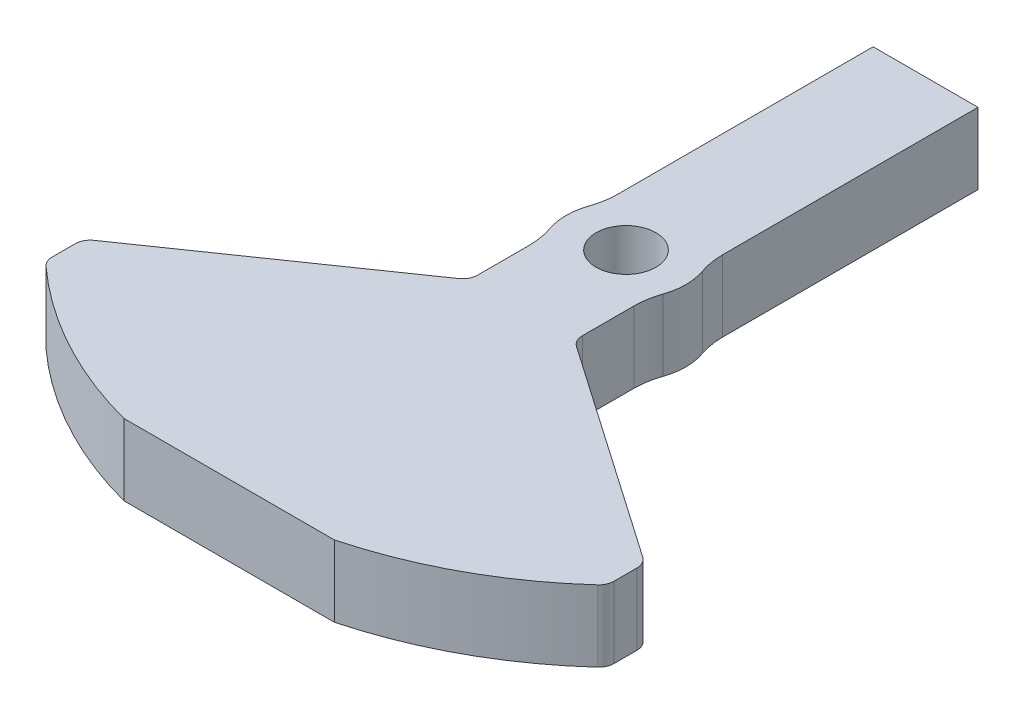
ISO-10303-21;
HEADER;
FILE_DESCRIPTION(('STEP AP214'),'2;1');
FILE_NAME('part.step','',(''),(''),'','','');
FILE_SCHEMA(('AUTOMOTIVE_DESIGN { 1 0 10303 214 1 1 1 1 }'));
ENDSEC;
DATA;
#1=APPLICATION_CONTEXT('core data for automotive mechanical design processes');
#2=APPLICATION_PROTOCOL_DEFINITION('international standard','automotive_design',2000,#1);
#3=PRODUCT_CONTEXT('',#1,'mechanical');
#4=PRODUCT('Part','Part','',(#3));
#5=PRODUCT_RELATED_PRODUCT_CATEGORY('part','',(#4));
#6=PRODUCT_DEFINITION_FORMATION('','',#4);
#7=PRODUCT_DEFINITION_CONTEXT('part definition',#1,'design');
#8=PRODUCT_DEFINITION('design','',#6,#7);
#9=PRODUCT_DEFINITION_SHAPE('','',#8);
#10=(LENGTH_UNIT() NAMED_UNIT(*) SI_UNIT(.MILLI.,.METRE.));
#11=(NAMED_UNIT(*) PLANE_ANGLE_UNIT() SI_UNIT($,.RADIAN.));
#12=(NAMED_UNIT(*) SI_UNIT($,.STERADIAN.) SOLID_ANGLE_UNIT());
#13=UNCERTAINTY_MEASURE_WITH_UNIT(LENGTH_MEASURE(1.E-05),#10,'distance_accuracy_value','');
#14=(GEOMETRIC_REPRESENTATION_CONTEXT(3) GLOBAL_UNCERTAINTY_ASSIGNED_CONTEXT((#13)) GLOBAL_UNIT_ASSIGNED_CONTEXT((#10,
#11,#12)) REPRESENTATION_CONTEXT('',''));
#15=CARTESIAN_POINT('',(0.,0.,0.));
#16=DIRECTION('',(0.,0.,1.));
#17=DIRECTION('',(1.,0.,0.));
#18=AXIS2_PLACEMENT_3D('',#15,#16,#17);
#19=CARTESIAN_POINT('',(0.,9.525,0.));
#20=DIRECTION('',(0.,1.,0.));
#21=DIRECTION('',(0.,0.,1.));
#22=AXIS2_PLACEMENT_3D('',#19,#20,#21);
#23=PLANE('',#22);
#24=CARTESIAN_POINT('',(0.,9.525,0.));
#25=DIRECTION('',(0.,1.,0.));
#26=DIRECTION('',(0.,0.,1.));
#27=AXIS2_PLACEMENT_3D('',#24,#25,#26);
#28=CIRCLE('',#27,54.8292804986533);
#29=CARTESIAN_POINT('',(14.0445719051882,9.525,53.));
#30=VERTEX_POINT('',#29);
#31=CARTESIAN_POINT('',(36.8439516747121,9.525,40.6050886588304));
#32=VERTEX_POINT('',#31);
#33=EDGE_CURVE('E240',#30,#32,#28,.T.);
#34=ORIENTED_EDGE('',*,*,#33,.T.);
#35=CARTESIAN_POINT('',(35.5,9.525,39.1239425161293));
#36=DIRECTION('',(0.,1.,0.));
#37=DIRECTION('',(0.,0.,1.));
#38=AXIS2_PLACEMENT_3D('',#35,#36,#37);
#39=CIRCLE('',#38,2.);
#40=CARTESIAN_POINT('',(37.5,9.525,39.1239425161293));
#41=VERTEX_POINT('',#40);
#42=EDGE_CURVE('E362',#32,#41,#39,.T.);
#43=ORIENTED_EDGE('',*,*,#42,.T.);
#44=DIRECTION('',(0.,0.,-1.));
#45=VECTOR('',#44,1.);
#46=CARTESIAN_POINT('',(37.5,9.525,35.));
#47=LINE('',#46,#45);
#48=CARTESIAN_POINT('',(37.5,9.525,36.0475773853247));
#49=VERTEX_POINT('',#48);
#50=EDGE_CURVE('E243',#41,#49,#47,.T.);
#51=ORIENTED_EDGE('',*,*,#50,.T.);
#52=CARTESIAN_POINT('',(35.5,9.525,36.0475773853247));
#53=DIRECTION('',(0.,1.,0.));
#54=DIRECTION('',(0.,0.,1.));
#55=AXIS2_PLACEMENT_3D('',#52,#53,#54);
#56=CIRCLE('',#55,2.);
#57=CARTESIAN_POINT('',(36.638843785766,9.525,34.403486502307));
#58=VERTEX_POINT('',#57);
#59=EDGE_CURVE('E360',#49,#58,#56,.T.);
#60=ORIENTED_EDGE('',*,*,#59,.T.);
#61=DIRECTION('',(-0.822045441508871,0.,-0.569421892883023));
#62=VECTOR('',#61,1.);
#63=CARTESIAN_POINT('',(6.99999999999999,9.525,13.8729833462074));
#64=LINE('',#63,#62);
#65=CARTESIAN_POINT('',(7.86115621423395,9.525,14.4694968439005));
#66=VERTEX_POINT('',#65);
#67=EDGE_CURVE('E246',#58,#66,#64,.T.);
#68=ORIENTED_EDGE('',*,*,#67,.T.);
#69=CARTESIAN_POINT('',(8.99999999999999,9.525,12.8254059608827));
#70=DIRECTION('',(0.,1.,0.));
#71=DIRECTION('',(0.,0.,1.));
#72=AXIS2_PLACEMENT_3D('',#69,#70,#71);
#73=CIRCLE('',#72,2.);
#74=CARTESIAN_POINT('',(6.99999999999999,9.525,12.8254059608827));
#75=VERTEX_POINT('',#74);
#76=EDGE_CURVE('E50',#66,#75,#73,.F.);
#77=ORIENTED_EDGE('',*,*,#76,.T.);
#78=DIRECTION('',(0.,0.,-1.));
#79=VECTOR('',#78,1.);
#80=CARTESIAN_POINT('',(6.99999999999999,9.525,3.87298334620743));
#81=LINE('',#80,#79);
#82=CARTESIAN_POINT('',(6.99999999999999,9.525,5.91607978309966));
#83=VERTEX_POINT('',#82);
#84=EDGE_CURVE('E248',#75,#83,#81,.T.);
#85=ORIENTED_EDGE('',*,*,#84,.T.);
#86=CARTESIAN_POINT('',(17.,9.525,5.91607978309966));
#87=DIRECTION('',(0.,1.,0.));
#88=DIRECTION('',(0.,0.,1.));
#89=AXIS2_PLACEMENT_3D('',#86,#87,#88);
#90=CIRCLE('',#89,10.);
#91=CARTESIAN_POINT('',(7.55555555555555,9.525,2.62936879248874));
#92=VERTEX_POINT('',#91);
#93=EDGE_CURVE('E335',#83,#92,#90,.F.);
#94=ORIENTED_EDGE('',*,*,#93,.T.);
#95=CARTESIAN_POINT('',(0.,9.525,0.));
#96=DIRECTION('',(0.,1.,0.));
#97=DIRECTION('',(0.,0.,1.));
#98=AXIS2_PLACEMENT_3D('',#95,#96,#97);
#99=CIRCLE('',#98,8.);
#100=CARTESIAN_POINT('',(7.55555555555555,9.525,-2.62936879248873));
#101=VERTEX_POINT('',#100);
#102=EDGE_CURVE('E250',#92,#101,#99,.T.);
#103=ORIENTED_EDGE('',*,*,#102,.T.);
#104=CARTESIAN_POINT('',(17.,9.525,-5.91607978309964));
#105=DIRECTION('',(0.,1.,0.));
#106=DIRECTION('',(0.,0.,1.));
#107=AXIS2_PLACEMENT_3D('',#104,#105,#106);
#108=CIRCLE('',#107,10.);
#109=CARTESIAN_POINT('',(7.,9.525,-5.91607978309964));
#110=VERTEX_POINT('',#109);
#111=EDGE_CURVE('E330',#101,#110,#108,.F.);
#112=ORIENTED_EDGE('',*,*,#111,.T.);
#113=DIRECTION('',(0.,0.,-1.));
#114=VECTOR('',#113,1.);
#115=CARTESIAN_POINT('',(7.,9.525,-40.));
#116=LINE('',#115,#114);
#117=CARTESIAN_POINT('',(7.,9.525,-40.));
#118=VERTEX_POINT('',#117);
#119=EDGE_CURVE('E253',#110,#118,#116,.T.);
#120=ORIENTED_EDGE('',*,*,#119,.T.);
#121=DIRECTION('',(-1.,0.,0.));
#122=VECTOR('',#121,1.);
#123=CARTESIAN_POINT('',(-7.,9.525,-40.));
#124=LINE('',#123,#122);
#125=CARTESIAN_POINT('',(-7.,9.525,-40.));
#126=VERTEX_POINT('',#125);
#127=EDGE_CURVE('E255',#118,#126,#124,.T.);
#128=ORIENTED_EDGE('',*,*,#127,.T.);
#129=DIRECTION('',(0.,0.,1.));
#130=VECTOR('',#129,1.);
#131=CARTESIAN_POINT('',(-7.,9.525,-40.));
#132=LINE('',#131,#130);
#133=CARTESIAN_POINT('',(-6.99999999999999,9.525,-5.91607978309967));
#134=VERTEX_POINT('',#133);
#135=EDGE_CURVE('E220',#126,#134,#132,.T.);
#136=ORIENTED_EDGE('',*,*,#135,.T.);
#137=CARTESIAN_POINT('',(-17.,9.525,-5.91607978309966));
#138=DIRECTION('',(0.,1.,0.));
#139=DIRECTION('',(0.,0.,1.));
#140=AXIS2_PLACEMENT_3D('',#137,#138,#139);
#141=CIRCLE('',#140,10.);
#142=CARTESIAN_POINT('',(-7.55555555555555,9.525,-2.62936879248874));
#143=VERTEX_POINT('',#142);
#144=EDGE_CURVE('E326',#134,#143,#141,.F.);
#145=ORIENTED_EDGE('',*,*,#144,.T.);
#146=CARTESIAN_POINT('',(0.,9.525,0.));
#147=DIRECTION('',(0.,1.,0.));
#148=DIRECTION('',(0.,0.,1.));
#149=AXIS2_PLACEMENT_3D('',#146,#147,#148);
#150=CIRCLE('',#149,8.);
#151=CARTESIAN_POINT('',(-7.55555555555555,9.525,2.62936879248874));
#152=VERTEX_POINT('',#151);
#153=EDGE_CURVE('E223',#143,#152,#150,.T.);
#154=ORIENTED_EDGE('',*,*,#153,.T.);
#155=CARTESIAN_POINT('',(-17.,9.525,5.91607978309966));
#156=DIRECTION('',(0.,1.,0.));
#157=DIRECTION('',(0.,0.,1.));
#158=AXIS2_PLACEMENT_3D('',#155,#156,#157);
#159=CIRCLE('',#158,10.);
#160=CARTESIAN_POINT('',(-6.99999999999999,9.525,5.91607978309966));
#161=VERTEX_POINT('',#160);
#162=EDGE_CURVE('E339',#152,#161,#159,.F.);
#163=ORIENTED_EDGE('',*,*,#162,.T.);
#164=DIRECTION('',(0.,0.,1.));
#165=VECTOR('',#164,1.);
#166=CARTESIAN_POINT('',(-6.99999999999999,9.525,3.87298334620743));
#167=LINE('',#166,#165);
#168=CARTESIAN_POINT('',(-6.99999999999999,9.525,12.8254059608827));
#169=VERTEX_POINT('',#168);
#170=EDGE_CURVE('E227',#161,#169,#167,.T.);
#171=ORIENTED_EDGE('',*,*,#170,.T.);
#172=CARTESIAN_POINT('',(-8.99999999999999,9.525,12.8254059608827));
#173=DIRECTION('',(0.,1.,0.));
#174=DIRECTION('',(0.,0.,1.));
#175=AXIS2_PLACEMENT_3D('',#172,#173,#174);
#176=CIRCLE('',#175,2.);
#177=CARTESIAN_POINT('',(-7.86115621423394,9.525,14.4694968439005));
#178=VERTEX_POINT('',#177);
#179=EDGE_CURVE('E11',#169,#178,#176,.F.);
#180=ORIENTED_EDGE('',*,*,#179,.T.);
#181=DIRECTION('',(-0.822045441508871,0.,0.569421892883023));
#182=VECTOR('',#181,1.);
#183=CARTESIAN_POINT('',(-37.5,9.525,35.));
#184=LINE('',#183,#182);
#185=CARTESIAN_POINT('',(-36.638843785766,9.525,34.403486502307));
#186=VERTEX_POINT('',#185);
#187=EDGE_CURVE('E230',#178,#186,#184,.T.);
#188=ORIENTED_EDGE('',*,*,#187,.T.);
#189=CARTESIAN_POINT('',(-35.5,9.525,36.0475773853247));
#190=DIRECTION('',(0.,1.,0.));
#191=DIRECTION('',(0.,0.,1.));
#192=AXIS2_PLACEMENT_3D('',#189,#190,#191);
#193=CIRCLE('',#192,2.);
#194=CARTESIAN_POINT('',(-37.5,9.525,36.0475773853247));
#195=VERTEX_POINT('',#194);
#196=EDGE_CURVE('E356',#186,#195,#193,.T.);
#197=ORIENTED_EDGE('',*,*,#196,.T.);
#198=DIRECTION('',(0.,0.,1.));
#199=VECTOR('',#198,1.);
#200=CARTESIAN_POINT('',(-37.5,9.525,35.));
#201=LINE('',#200,#199);
#202=CARTESIAN_POINT('',(-37.5,9.525,39.1239425161293));
#203=VERTEX_POINT('',#202);
#204=EDGE_CURVE('E233',#195,#203,#201,.T.);
#205=ORIENTED_EDGE('',*,*,#204,.T.);
#206=CARTESIAN_POINT('',(-35.5,9.525,39.1239425161293));
#207=DIRECTION('',(0.,1.,0.));
#208=DIRECTION('',(0.,0.,1.));
#209=AXIS2_PLACEMENT_3D('',#206,#207,#208);
#210=CIRCLE('',#209,2.);
#211=CARTESIAN_POINT('',(-36.8439516747121,9.525,40.6050886588304));
#212=VERTEX_POINT('',#211);
#213=EDGE_CURVE('E358',#203,#212,#210,.T.);
#214=ORIENTED_EDGE('',*,*,#213,.T.);
#215=CARTESIAN_POINT('',(0.,9.525,0.));
#216=DIRECTION('',(0.,1.,0.));
#217=DIRECTION('',(0.,0.,1.));
#218=AXIS2_PLACEMENT_3D('',#215,#216,#217);
#219=CIRCLE('',#218,54.8292804986533);
#220=CARTESIAN_POINT('',(-14.0445719051882,9.525,53.));
#221=VERTEX_POINT('',#220);
#222=EDGE_CURVE('E236',#212,#221,#219,.T.);
#223=ORIENTED_EDGE('',*,*,#222,.T.);
#224=DIRECTION('',(1.,0.,0.));
#225=VECTOR('',#224,1.);
#226=CARTESIAN_POINT('',(-14.0445719051882,9.525,53.));
#227=LINE('',#226,#225);
#228=EDGE_CURVE('E238',#221,#30,#227,.T.);
#229=ORIENTED_EDGE('',*,*,#228,.T.);
#230=EDGE_LOOP('',(#34,#43,#51,#60,#68,#77,#85,#94,#103,#112,#120,#128,#136,#145,#154,#163,#171,
#180,#188,#197,#205,#214,#223,#229));
#231=FACE_BOUND('',#230,.T.);
#232=CARTESIAN_POINT('',(0.,9.525,0.));
#233=DIRECTION('',(0.,1.,0.));
#234=DIRECTION('',(0.,0.,1.));
#235=AXIS2_PLACEMENT_3D('',#232,#233,#234);
#236=CIRCLE('',#235,4.);
#237=CARTESIAN_POINT('',(0.,9.525,4.));
#238=VERTEX_POINT('',#237);
#239=EDGE_CURVE('E212',#238,#238,#236,.T.);
#240=ORIENTED_EDGE('',*,*,#239,.F.);
#241=EDGE_LOOP('',(#240));
#242=FACE_BOUND('',#241,.T.);
#243=ADVANCED_FACE('F35',(#231,#242),#23,.T.);
#244=CARTESIAN_POINT('',(0.,0.,0.));
#245=DIRECTION('',(0.,1.,0.));
#246=DIRECTION('',(0.,0.,1.));
#247=AXIS2_PLACEMENT_3D('',#244,#245,#246);
#248=PLANE('',#247);
#249=DIRECTION('',(0.,0.,-1.));
#250=VECTOR('',#249,1.);
#251=CARTESIAN_POINT('',(37.5,0.,35.));
#252=LINE('',#251,#250);
#253=CARTESIAN_POINT('',(37.5,0.,39.1239425161293));
#254=VERTEX_POINT('',#253);
#255=CARTESIAN_POINT('',(37.5,0.,36.0475773853247));
#256=VERTEX_POINT('',#255);
#257=EDGE_CURVE('E279',#254,#256,#252,.T.);
#258=ORIENTED_EDGE('',*,*,#257,.F.);
#259=CARTESIAN_POINT('',(35.5,0.,39.1239425161293));
#260=DIRECTION('',(0.,1.,0.));
#261=DIRECTION('',(0.,0.,1.));
#262=AXIS2_PLACEMENT_3D('',#259,#260,#261);
#263=CIRCLE('',#262,2.);
#264=CARTESIAN_POINT('',(36.8439516747121,0.,40.6050886588304));
#265=VERTEX_POINT('',#264);
#266=EDGE_CURVE('E352',#254,#265,#263,.F.);
#267=ORIENTED_EDGE('',*,*,#266,.T.);
#268=CARTESIAN_POINT('',(0.,0.,0.));
#269=DIRECTION('',(0.,1.,0.));
#270=DIRECTION('',(0.,0.,1.));
#271=AXIS2_PLACEMENT_3D('',#268,#269,#270);
#272=CIRCLE('',#271,54.8292804986533);
#273=CARTESIAN_POINT('',(14.0445719051882,0.,53.));
#274=VERTEX_POINT('',#273);
#275=EDGE_CURVE('E276',#274,#265,#272,.T.);
#276=ORIENTED_EDGE('',*,*,#275,.F.);
#277=DIRECTION('',(1.,0.,0.));
#278=VECTOR('',#277,1.);
#279=CARTESIAN_POINT('',(-14.0445719051882,0.,53.));
#280=LINE('',#279,#278);
#281=CARTESIAN_POINT('',(-14.0445719051882,0.,53.));
#282=VERTEX_POINT('',#281);
#283=EDGE_CURVE('E274',#282,#274,#280,.T.);
#284=ORIENTED_EDGE('',*,*,#283,.F.);
#285=CARTESIAN_POINT('',(0.,0.,0.));
#286=DIRECTION('',(0.,1.,0.));
#287=DIRECTION('',(0.,0.,1.));
#288=AXIS2_PLACEMENT_3D('',#285,#286,#287);
#289=CIRCLE('',#288,54.8292804986533);
#290=CARTESIAN_POINT('',(-36.8439516747121,0.,40.6050886588304));
#291=VERTEX_POINT('',#290);
#292=EDGE_CURVE('E272',#291,#282,#289,.T.);
#293=ORIENTED_EDGE('',*,*,#292,.F.);
#294=CARTESIAN_POINT('',(-35.5,0.,39.1239425161293));
#295=DIRECTION('',(0.,1.,0.));
#296=DIRECTION('',(0.,0.,1.));
#297=AXIS2_PLACEMENT_3D('',#294,#295,#296);
#298=CIRCLE('',#297,2.);
#299=CARTESIAN_POINT('',(-37.5,0.,39.1239425161293));
#300=VERTEX_POINT('',#299);
#301=EDGE_CURVE('E348',#291,#300,#298,.F.);
#302=ORIENTED_EDGE('',*,*,#301,.T.);
#303=DIRECTION('',(0.,0.,1.));
#304=VECTOR('',#303,1.);
#305=CARTESIAN_POINT('',(-37.5,0.,35.));
#306=LINE('',#305,#304);
#307=CARTESIAN_POINT('',(-37.5,0.,36.0475773853247));
#308=VERTEX_POINT('',#307);
#309=EDGE_CURVE('E269',#308,#300,#306,.T.);
#310=ORIENTED_EDGE('',*,*,#309,.F.);
#311=CARTESIAN_POINT('',(-35.5,0.,36.0475773853247));
#312=DIRECTION('',(0.,1.,0.));
#313=DIRECTION('',(0.,0.,1.));
#314=AXIS2_PLACEMENT_3D('',#311,#312,#313);
#315=CIRCLE('',#314,2.);
#316=CARTESIAN_POINT('',(-36.638843785766,0.,34.403486502307));
#317=VERTEX_POINT('',#316);
#318=EDGE_CURVE('E346',#308,#317,#315,.F.);
#319=ORIENTED_EDGE('',*,*,#318,.T.);
#320=DIRECTION('',(-0.822045441508871,0.,0.569421892883023));
#321=VECTOR('',#320,1.);
#322=CARTESIAN_POINT('',(-37.5,0.,35.));
#323=LINE('',#322,#321);
#324=CARTESIAN_POINT('',(-7.86115621423394,0.,14.4694968439005));
#325=VERTEX_POINT('',#324);
#326=EDGE_CURVE('E266',#325,#317,#323,.T.);
#327=ORIENTED_EDGE('',*,*,#326,.F.);
#328=CARTESIAN_POINT('',(-8.99999999999999,0.,12.8254059608827));
#329=DIRECTION('',(0.,1.,0.));
#330=DIRECTION('',(0.,0.,1.));
#331=AXIS2_PLACEMENT_3D('',#328,#329,#330);
#332=CIRCLE('',#331,2.);
#333=CARTESIAN_POINT('',(-6.99999999999999,0.,12.8254059608827));
#334=VERTEX_POINT('',#333);
#335=EDGE_CURVE('E43',#325,#334,#332,.T.);
#336=ORIENTED_EDGE('',*,*,#335,.T.);
#337=DIRECTION('',(0.,0.,1.));
#338=VECTOR('',#337,1.);
#339=CARTESIAN_POINT('',(-6.99999999999999,0.,3.87298334620743));
#340=LINE('',#339,#338);
#341=CARTESIAN_POINT('',(-6.99999999999999,0.,5.91607978309966));
#342=VERTEX_POINT('',#341);
#343=EDGE_CURVE('E263',#342,#334,#340,.T.);
#344=ORIENTED_EDGE('',*,*,#343,.F.);
#345=CARTESIAN_POINT('',(-17.,0.,5.91607978309966));
#346=DIRECTION('',(0.,1.,0.));
#347=DIRECTION('',(0.,0.,1.));
#348=AXIS2_PLACEMENT_3D('',#345,#346,#347);
#349=CIRCLE('',#348,10.);
#350=CARTESIAN_POINT('',(-7.55555555555555,0.,2.62936879248874));
#351=VERTEX_POINT('',#350);
#352=EDGE_CURVE('E337',#342,#351,#349,.T.);
#353=ORIENTED_EDGE('',*,*,#352,.T.);
#354=CARTESIAN_POINT('',(0.,0.,0.));
#355=DIRECTION('',(0.,1.,0.));
#356=DIRECTION('',(0.,0.,1.));
#357=AXIS2_PLACEMENT_3D('',#354,#355,#356);
#358=CIRCLE('',#357,8.);
#359=CARTESIAN_POINT('',(-7.55555555555555,0.,-2.62936879248874));
#360=VERTEX_POINT('',#359);
#361=EDGE_CURVE('E260',#360,#351,#358,.T.);
#362=ORIENTED_EDGE('',*,*,#361,.F.);
#363=CARTESIAN_POINT('',(-17.,0.,-5.91607978309966));
#364=DIRECTION('',(0.,1.,0.));
#365=DIRECTION('',(0.,0.,1.));
#366=AXIS2_PLACEMENT_3D('',#363,#364,#365);
#367=CIRCLE('',#366,10.);
#368=CARTESIAN_POINT('',(-6.99999999999999,0.,-5.91607978309967));
#369=VERTEX_POINT('',#368);
#370=EDGE_CURVE('E324',#360,#369,#367,.T.);
#371=ORIENTED_EDGE('',*,*,#370,.T.);
#372=DIRECTION('',(0.,0.,1.));
#373=VECTOR('',#372,1.);
#374=CARTESIAN_POINT('',(-7.,0.,-40.));
#375=LINE('',#374,#373);
#376=CARTESIAN_POINT('',(-7.,0.,-40.));
#377=VERTEX_POINT('',#376);
#378=EDGE_CURVE('E218',#377,#369,#375,.T.);
#379=ORIENTED_EDGE('',*,*,#378,.F.);
#380=DIRECTION('',(-1.,0.,0.));
#381=VECTOR('',#380,1.);
#382=CARTESIAN_POINT('',(-7.,0.,-40.));
#383=LINE('',#382,#381);
#384=CARTESIAN_POINT('',(7.,0.,-40.));
#385=VERTEX_POINT('',#384);
#386=EDGE_CURVE('E224',#385,#377,#383,.T.);
#387=ORIENTED_EDGE('',*,*,#386,.F.);
#388=DIRECTION('',(0.,0.,-1.));
#389=VECTOR('',#388,1.);
#390=CARTESIAN_POINT('',(7.,0.,-40.));
#391=LINE('',#390,#389);
#392=CARTESIAN_POINT('',(7.,0.,-5.91607978309964));
#393=VERTEX_POINT('',#392);
#394=EDGE_CURVE('E289',#393,#385,#391,.T.);
#395=ORIENTED_EDGE('',*,*,#394,.F.);
#396=CARTESIAN_POINT('',(17.,0.,-5.91607978309964));
#397=DIRECTION('',(0.,1.,0.));
#398=DIRECTION('',(0.,0.,1.));
#399=AXIS2_PLACEMENT_3D('',#396,#397,#398);
#400=CIRCLE('',#399,10.);
#401=CARTESIAN_POINT('',(7.55555555555555,0.,-2.62936879248873));
#402=VERTEX_POINT('',#401);
#403=EDGE_CURVE('E328',#393,#402,#400,.T.);
#404=ORIENTED_EDGE('',*,*,#403,.T.);
#405=CARTESIAN_POINT('',(0.,0.,0.));
#406=DIRECTION('',(0.,1.,0.));
#407=DIRECTION('',(0.,0.,1.));
#408=AXIS2_PLACEMENT_3D('',#405,#406,#407);
#409=CIRCLE('',#408,8.);
#410=CARTESIAN_POINT('',(7.55555555555555,0.,2.62936879248874));
#411=VERTEX_POINT('',#410);
#412=EDGE_CURVE('E286',#411,#402,#409,.T.);
#413=ORIENTED_EDGE('',*,*,#412,.F.);
#414=CARTESIAN_POINT('',(17.,0.,5.91607978309966));
#415=DIRECTION('',(0.,1.,0.));
#416=DIRECTION('',(0.,0.,1.));
#417=AXIS2_PLACEMENT_3D('',#414,#415,#416);
#418=CIRCLE('',#417,10.);
#419=CARTESIAN_POINT('',(6.99999999999999,0.,5.91607978309966));
#420=VERTEX_POINT('',#419);
#421=EDGE_CURVE('E332',#411,#420,#418,.T.);
#422=ORIENTED_EDGE('',*,*,#421,.T.);
#423=DIRECTION('',(0.,0.,-1.));
#424=VECTOR('',#423,1.);
#425=CARTESIAN_POINT('',(6.99999999999999,0.,3.87298334620743));
#426=LINE('',#425,#424);
#427=CARTESIAN_POINT('',(6.99999999999999,0.,12.8254059608827));
#428=VERTEX_POINT('',#427);
#429=EDGE_CURVE('E284',#428,#420,#426,.T.);
#430=ORIENTED_EDGE('',*,*,#429,.F.);
#431=CARTESIAN_POINT('',(8.99999999999999,0.,12.8254059608827));
#432=DIRECTION('',(0.,1.,0.));
#433=DIRECTION('',(0.,0.,1.));
#434=AXIS2_PLACEMENT_3D('',#431,#432,#433);
#435=CIRCLE('',#434,2.);
#436=CARTESIAN_POINT('',(7.86115621423395,0.,14.4694968439005));
#437=VERTEX_POINT('',#436);
#438=EDGE_CURVE('E386',#428,#437,#435,.T.);
#439=ORIENTED_EDGE('',*,*,#438,.T.);
#440=DIRECTION('',(-0.822045441508871,0.,-0.569421892883023));
#441=VECTOR('',#440,1.);
#442=CARTESIAN_POINT('',(6.99999999999999,0.,13.8729833462074));
#443=LINE('',#442,#441);
#444=CARTESIAN_POINT('',(36.638843785766,0.,34.403486502307));
#445=VERTEX_POINT('',#444);
#446=EDGE_CURVE('E282',#445,#437,#443,.T.);
#447=ORIENTED_EDGE('',*,*,#446,.F.);
#448=CARTESIAN_POINT('',(35.5,0.,36.0475773853247));
#449=DIRECTION('',(0.,1.,0.));
#450=DIRECTION('',(0.,0.,1.));
#451=AXIS2_PLACEMENT_3D('',#448,#449,#450);
#452=CIRCLE('',#451,2.);
#453=EDGE_CURVE('E350',#445,#256,#452,.F.);
#454=ORIENTED_EDGE('',*,*,#453,.T.);
#455=EDGE_LOOP('',(#258,#267,#276,#284,#293,#302,#310,#319,#327,#336,#344,#353,#362,#371,#379,
#387,#395,#404,#413,#422,#430,#439,#447,#454));
#456=FACE_BOUND('',#455,.T.);
#457=CARTESIAN_POINT('',(0.,0.,0.));
#458=DIRECTION('',(0.,1.,0.));
#459=DIRECTION('',(0.,0.,1.));
#460=AXIS2_PLACEMENT_3D('',#457,#458,#459);
#461=CIRCLE('',#460,4.);
#462=CARTESIAN_POINT('',(0.,0.,4.));
#463=VERTEX_POINT('',#462);
#464=EDGE_CURVE('E208',#463,#463,#461,.T.);
#465=ORIENTED_EDGE('',*,*,#464,.T.);
#466=EDGE_LOOP('',(#465));
#467=FACE_BOUND('',#466,.T.);
#468=ADVANCED_FACE('F392',(#456,#467),#248,.F.);
#469=CARTESIAN_POINT('',(-7.,9.525,-40.));
#470=DIRECTION('',(1.,0.,0.));
#471=DIRECTION('',(0.,0.,-1.));
#472=AXIS2_PLACEMENT_3D('',#469,#470,#471);
#473=PLANE('',#472);
#474=ORIENTED_EDGE('',*,*,#378,.T.);
#475=DIRECTION('',(0.,1.,0.));
#476=VECTOR('',#475,1.);
#477=CARTESIAN_POINT('',(-6.99999999999999,9.525,-5.91607978309967));
#478=LINE('',#477,#476);
#479=EDGE_CURVE('E308',#369,#134,#478,.T.);
#480=ORIENTED_EDGE('',*,*,#479,.T.);
#481=ORIENTED_EDGE('',*,*,#135,.F.);
#482=DIRECTION('',(0.,-1.,0.));
#483=VECTOR('',#482,1.);
#484=CARTESIAN_POINT('',(-7.,9.525,-40.));
#485=LINE('',#484,#483);
#486=EDGE_CURVE('E257',#126,#377,#485,.T.);
#487=ORIENTED_EDGE('',*,*,#486,.T.);
#488=EDGE_LOOP('',(#474,#480,#481,#487));
#489=FACE_BOUND('',#488,.T.);
#490=ADVANCED_FACE('F505',(#489),#473,.F.);
#491=CARTESIAN_POINT('',(0.,9.525,0.));
#492=DIRECTION('',(0.,-1.,0.));
#493=DIRECTION('',(0.,0.,-1.));
#494=AXIS2_PLACEMENT_3D('',#491,#492,#493);
#495=CYLINDRICAL_SURFACE('',#494,8.);
#496=ORIENTED_EDGE('',*,*,#153,.F.);
#497=DIRECTION('',(0.,-1.,0.));
#498=VECTOR('',#497,1.);
#499=CARTESIAN_POINT('',(-7.55555555555555,9.525,-2.62936879248874));
#500=LINE('',#499,#498);
#501=EDGE_CURVE('E305',#143,#360,#500,.T.);
#502=ORIENTED_EDGE('',*,*,#501,.T.);
#503=ORIENTED_EDGE('',*,*,#361,.T.);
#504=DIRECTION('',(0.,-1.,0.));
#505=VECTOR('',#504,1.);
#506=CARTESIAN_POINT('',(-7.55555555555555,9.525,2.62936879248874));
#507=LINE('',#506,#505);
#508=EDGE_CURVE('E303',#351,#152,#507,.F.);
#509=ORIENTED_EDGE('',*,*,#508,.T.);
#510=EDGE_LOOP('',(#496,#502,#503,#509));
#511=FACE_BOUND('',#510,.T.);
#512=ADVANCED_FACE('F488',(#511),#495,.T.);
#513=CARTESIAN_POINT('',(-6.99999999999999,9.525,3.87298334620743));
#514=DIRECTION('',(1.,0.,0.));
#515=DIRECTION('',(0.,0.,-1.));
#516=AXIS2_PLACEMENT_3D('',#513,#514,#515);
#517=PLANE('',#516);
#518=ORIENTED_EDGE('',*,*,#343,.T.);
#519=DIRECTION('',(0.,-1.,0.));
#520=VECTOR('',#519,1.);
#521=CARTESIAN_POINT('',(-6.99999999999999,9.525,12.8254059608827));
#522=LINE('',#521,#520);
#523=EDGE_CURVE('E376',#334,#169,#522,.F.);
#524=ORIENTED_EDGE('',*,*,#523,.T.);
#525=ORIENTED_EDGE('',*,*,#170,.F.);
#526=DIRECTION('',(0.,1.,0.));
#527=VECTOR('',#526,1.);
#528=CARTESIAN_POINT('',(-6.99999999999999,0.,5.91607978309966));
#529=LINE('',#528,#527);
#530=EDGE_CURVE('E321',#161,#342,#529,.F.);
#531=ORIENTED_EDGE('',*,*,#530,.T.);
#532=EDGE_LOOP('',(#518,#524,#525,#531));
#533=FACE_BOUND('',#532,.T.);
#534=ADVANCED_FACE('F398',(#533),#517,.F.);
#535=CARTESIAN_POINT('',(-37.5,9.525,35.));
#536=DIRECTION('',(0.569421892883023,0.,0.822045441508871));
#537=DIRECTION('',(0.822045441508871,0.,-0.569421892883023));
#538=AXIS2_PLACEMENT_3D('',#535,#536,#537);
#539=PLANE('',#538);
#540=ORIENTED_EDGE('',*,*,#187,.F.);
#541=DIRECTION('',(0.,-1.,0.));
#542=VECTOR('',#541,1.);
#543=CARTESIAN_POINT('',(-7.86115621423394,0.,14.4694968439005));
#544=LINE('',#543,#542);
#545=EDGE_CURVE('E373',#178,#325,#544,.T.);
#546=ORIENTED_EDGE('',*,*,#545,.T.);
#547=ORIENTED_EDGE('',*,*,#326,.T.);
#548=DIRECTION('',(0.,-1.,0.));
#549=VECTOR('',#548,1.);
#550=CARTESIAN_POINT('',(-36.638843785766,9.525,34.403486502307));
#551=LINE('',#550,#549);
#552=EDGE_CURVE('E371',#317,#186,#551,.F.);
#553=ORIENTED_EDGE('',*,*,#552,.T.);
#554=EDGE_LOOP('',(#540,#546,#547,#553));
#555=FACE_BOUND('',#554,.T.);
#556=ADVANCED_FACE('F407',(#555),#539,.F.);
#557=CARTESIAN_POINT('',(-37.5,9.525,35.));
#558=DIRECTION('',(1.,0.,0.));
#559=DIRECTION('',(0.,0.,-1.));
#560=AXIS2_PLACEMENT_3D('',#557,#558,#559);
#561=PLANE('',#560);
#562=ORIENTED_EDGE('',*,*,#309,.T.);
#563=DIRECTION('',(0.,-1.,0.));
#564=VECTOR('',#563,1.);
#565=CARTESIAN_POINT('',(-37.5,9.525,39.1239425161293));
#566=LINE('',#565,#564);
#567=EDGE_CURVE('E384',#300,#203,#566,.F.);
#568=ORIENTED_EDGE('',*,*,#567,.T.);
#569=ORIENTED_EDGE('',*,*,#204,.F.);
#570=DIRECTION('',(0.,-1.,0.));
#571=VECTOR('',#570,1.);
#572=CARTESIAN_POINT('',(-37.5,9.525,36.0475773853247));
#573=LINE('',#572,#571);
#574=EDGE_CURVE('E381',#195,#308,#573,.T.);
#575=ORIENTED_EDGE('',*,*,#574,.T.);
#576=EDGE_LOOP('',(#562,#568,#569,#575));
#577=FACE_BOUND('',#576,.T.);
#578=ADVANCED_FACE('F414',(#577),#561,.F.);
#579=CARTESIAN_POINT('',(0.,9.525,0.));
#580=DIRECTION('',(0.,-1.,0.));
#581=DIRECTION('',(0.,0.,-1.));
#582=AXIS2_PLACEMENT_3D('',#579,#580,#581);
#583=CYLINDRICAL_SURFACE('',#582,54.8292804986533);
#584=ORIENTED_EDGE('',*,*,#222,.F.);
#585=DIRECTION('',(0.,-1.,0.));
#586=VECTOR('',#585,1.);
#587=CARTESIAN_POINT('',(-36.8439516747121,9.525,40.6050886588304));
#588=LINE('',#587,#586);
#589=EDGE_CURVE('E378',#212,#291,#588,.T.);
#590=ORIENTED_EDGE('',*,*,#589,.T.);
#591=ORIENTED_EDGE('',*,*,#292,.T.);
#592=DIRECTION('',(0.,-1.,0.));
#593=VECTOR('',#592,1.);
#594=CARTESIAN_POINT('',(-14.0445719051882,9.525,53.));
#595=LINE('',#594,#593);
#596=EDGE_CURVE('E300',#221,#282,#595,.T.);
#597=ORIENTED_EDGE('',*,*,#596,.F.);
#598=EDGE_LOOP('',(#584,#590,#591,#597));
#599=FACE_BOUND('',#598,.T.);
#600=ADVANCED_FACE('F423',(#599),#583,.T.);
#601=CARTESIAN_POINT('',(-14.0445719051882,9.525,53.));
#602=DIRECTION('',(0.,0.,-1.));
#603=DIRECTION('',(-1.,0.,0.));
#604=AXIS2_PLACEMENT_3D('',#601,#602,#603);
#605=PLANE('',#604);
#606=ORIENTED_EDGE('',*,*,#283,.T.);
#607=DIRECTION('',(0.,-1.,0.));
#608=VECTOR('',#607,1.);
#609=CARTESIAN_POINT('',(14.0445719051882,9.525,53.));
#610=LINE('',#609,#608);
#611=EDGE_CURVE('E297',#30,#274,#610,.T.);
#612=ORIENTED_EDGE('',*,*,#611,.F.);
#613=ORIENTED_EDGE('',*,*,#228,.F.);
#614=ORIENTED_EDGE('',*,*,#596,.T.);
#615=EDGE_LOOP('',(#606,#612,#613,#614));
#616=FACE_BOUND('',#615,.T.);
#617=ADVANCED_FACE('F429',(#616),#605,.F.);
#618=CARTESIAN_POINT('',(0.,9.525,0.));
#619=DIRECTION('',(0.,-1.,0.));
#620=DIRECTION('',(0.,0.,-1.));
#621=AXIS2_PLACEMENT_3D('',#618,#619,#620);
#622=CYLINDRICAL_SURFACE('',#621,54.8292804986533);
#623=ORIENTED_EDGE('',*,*,#275,.T.);
#624=DIRECTION('',(0.,-1.,0.));
#625=VECTOR('',#624,1.);
#626=CARTESIAN_POINT('',(36.8439516747121,9.525,40.6050886588304));
#627=LINE('',#626,#625);
#628=EDGE_CURVE('E354',#265,#32,#627,.F.);
#629=ORIENTED_EDGE('',*,*,#628,.T.);
#630=ORIENTED_EDGE('',*,*,#33,.F.);
#631=ORIENTED_EDGE('',*,*,#611,.T.);
#632=EDGE_LOOP('',(#623,#629,#630,#631));
#633=FACE_BOUND('',#632,.T.);
#634=ADVANCED_FACE('F523',(#633),#622,.T.);
#635=CARTESIAN_POINT('',(37.5,9.525,35.));
#636=DIRECTION('',(-1.,0.,0.));
#637=DIRECTION('',(0.,0.,1.));
#638=AXIS2_PLACEMENT_3D('',#635,#636,#637);
#639=PLANE('',#638);
#640=ORIENTED_EDGE('',*,*,#50,.F.);
#641=DIRECTION('',(0.,-1.,0.));
#642=VECTOR('',#641,1.);
#643=CARTESIAN_POINT('',(37.5,9.525,39.1239425161293));
#644=LINE('',#643,#642);
#645=EDGE_CURVE('E343',#41,#254,#644,.T.);
#646=ORIENTED_EDGE('',*,*,#645,.T.);
#647=ORIENTED_EDGE('',*,*,#257,.T.);
#648=DIRECTION('',(0.,-1.,0.));
#649=VECTOR('',#648,1.);
#650=CARTESIAN_POINT('',(37.5,9.525,36.0475773853247));
#651=LINE('',#650,#649);
#652=EDGE_CURVE('E341',#256,#49,#651,.F.);
#653=ORIENTED_EDGE('',*,*,#652,.T.);
#654=EDGE_LOOP('',(#640,#646,#647,#653));
#655=FACE_BOUND('',#654,.T.);
#656=ADVANCED_FACE('F439',(#655),#639,.F.);
#657=CARTESIAN_POINT('',(6.99999999999999,9.525,13.8729833462074));
#658=DIRECTION('',(-0.569421892883023,0.,0.822045441508871));
#659=DIRECTION('',(0.822045441508871,0.,0.569421892883023));
#660=AXIS2_PLACEMENT_3D('',#657,#658,#659);
#661=PLANE('',#660);
#662=ORIENTED_EDGE('',*,*,#67,.F.);
#663=DIRECTION('',(0.,-1.,0.));
#664=VECTOR('',#663,1.);
#665=CARTESIAN_POINT('',(36.638843785766,9.525,34.403486502307));
#666=LINE('',#665,#664);
#667=EDGE_CURVE('E365',#58,#445,#666,.T.);
#668=ORIENTED_EDGE('',*,*,#667,.T.);
#669=ORIENTED_EDGE('',*,*,#446,.T.);
#670=DIRECTION('',(0.,-1.,0.));
#671=VECTOR('',#670,1.);
#672=CARTESIAN_POINT('',(7.86115621423395,9.525,14.4694968439005));
#673=LINE('',#672,#671);
#674=EDGE_CURVE('E58',#437,#66,#673,.F.);
#675=ORIENTED_EDGE('',*,*,#674,.T.);
#676=EDGE_LOOP('',(#662,#668,#669,#675));
#677=FACE_BOUND('',#676,.T.);
#678=ADVANCED_FACE('F447',(#677),#661,.F.);
#679=CARTESIAN_POINT('',(6.99999999999999,9.525,3.87298334620743));
#680=DIRECTION('',(-1.,0.,0.));
#681=DIRECTION('',(0.,0.,1.));
#682=AXIS2_PLACEMENT_3D('',#679,#680,#681);
#683=PLANE('',#682);
#684=ORIENTED_EDGE('',*,*,#84,.F.);
#685=DIRECTION('',(0.,-1.,0.));
#686=VECTOR('',#685,1.);
#687=CARTESIAN_POINT('',(6.99999999999999,0.,12.8254059608827));
#688=LINE('',#687,#686);
#689=EDGE_CURVE('E368',#75,#428,#688,.T.);
#690=ORIENTED_EDGE('',*,*,#689,.T.);
#691=ORIENTED_EDGE('',*,*,#429,.T.);
#692=DIRECTION('',(0.,1.,0.));
#693=VECTOR('',#692,1.);
#694=CARTESIAN_POINT('',(6.99999999999999,9.525,5.91607978309966));
#695=LINE('',#694,#693);
#696=EDGE_CURVE('E318',#420,#83,#695,.T.);
#697=ORIENTED_EDGE('',*,*,#696,.T.);
#698=EDGE_LOOP('',(#684,#690,#691,#697));
#699=FACE_BOUND('',#698,.T.);
#700=ADVANCED_FACE('F453',(#699),#683,.F.);
#701=CARTESIAN_POINT('',(0.,9.525,0.));
#702=DIRECTION('',(0.,-1.,0.));
#703=DIRECTION('',(0.,0.,-1.));
#704=AXIS2_PLACEMENT_3D('',#701,#702,#703);
#705=CYLINDRICAL_SURFACE('',#704,8.);
#706=ORIENTED_EDGE('',*,*,#412,.T.);
#707=DIRECTION('',(0.,-1.,0.));
#708=VECTOR('',#707,1.);
#709=CARTESIAN_POINT('',(7.55555555555555,9.525,-2.62936879248873));
#710=LINE('',#709,#708);
#711=EDGE_CURVE('E316',#402,#101,#710,.F.);
#712=ORIENTED_EDGE('',*,*,#711,.T.);
#713=ORIENTED_EDGE('',*,*,#102,.F.);
#714=DIRECTION('',(0.,-1.,0.));
#715=VECTOR('',#714,1.);
#716=CARTESIAN_POINT('',(7.55555555555555,9.525,2.62936879248874));
#717=LINE('',#716,#715);
#718=EDGE_CURVE('E313',#92,#411,#717,.T.);
#719=ORIENTED_EDGE('',*,*,#718,.T.);
#720=EDGE_LOOP('',(#706,#712,#713,#719));
#721=FACE_BOUND('',#720,.T.);
#722=ADVANCED_FACE('F463',(#721),#705,.T.);
#723=CARTESIAN_POINT('',(7.,9.525,-40.));
#724=DIRECTION('',(-1.,0.,0.));
#725=DIRECTION('',(0.,0.,1.));
#726=AXIS2_PLACEMENT_3D('',#723,#724,#725);
#727=PLANE('',#726);
#728=ORIENTED_EDGE('',*,*,#119,.F.);
#729=DIRECTION('',(0.,1.,0.));
#730=VECTOR('',#729,1.);
#731=CARTESIAN_POINT('',(7.,0.,-5.91607978309964));
#732=LINE('',#731,#730);
#733=EDGE_CURVE('E310',#110,#393,#732,.F.);
#734=ORIENTED_EDGE('',*,*,#733,.T.);
#735=ORIENTED_EDGE('',*,*,#394,.T.);
#736=DIRECTION('',(0.,-1.,0.));
#737=VECTOR('',#736,1.);
#738=CARTESIAN_POINT('',(7.,9.525,-40.));
#739=LINE('',#738,#737);
#740=EDGE_CURVE('E294',#118,#385,#739,.T.);
#741=ORIENTED_EDGE('',*,*,#740,.F.);
#742=EDGE_LOOP('',(#728,#734,#735,#741));
#743=FACE_BOUND('',#742,.T.);
#744=ADVANCED_FACE('F471',(#743),#727,.F.);
#745=CARTESIAN_POINT('',(-7.,9.525,-40.));
#746=DIRECTION('',(0.,0.,1.));
#747=DIRECTION('',(1.,0.,0.));
#748=AXIS2_PLACEMENT_3D('',#745,#746,#747);
#749=PLANE('',#748);
#750=CARTESIAN_POINT('',(0.,4.7625,-40.));
#751=DIRECTION('',(0.,0.,-1.));
#752=DIRECTION('',(-1.,0.,0.));
#753=AXIS2_PLACEMENT_3D('',#750,#751,#752);
#754=CIRCLE('',#753,3.4);
#755=CARTESIAN_POINT('',(-3.4,4.7625,-40.));
#756=VERTEX_POINT('',#755);
#757=EDGE_CURVE('E209',#756,#756,#754,.T.);
#758=ORIENTED_EDGE('',*,*,#757,.F.);
#759=EDGE_LOOP('',(#758));
#760=FACE_BOUND('',#759,.T.);
#761=ORIENTED_EDGE('',*,*,#386,.T.);
#762=ORIENTED_EDGE('',*,*,#486,.F.);
#763=ORIENTED_EDGE('',*,*,#127,.F.);
#764=ORIENTED_EDGE('',*,*,#740,.T.);
#765=EDGE_LOOP('',(#761,#762,#763,#764));
#766=FACE_BOUND('',#765,.T.);
#767=ADVANCED_FACE('F477',(#760,#766),#749,.F.);
#768=CARTESIAN_POINT('',(0.,9.525,0.));
#769=DIRECTION('',(0.,-1.,0.));
#770=DIRECTION('',(0.,0.,-1.));
#771=AXIS2_PLACEMENT_3D('',#768,#769,#770);
#772=CYLINDRICAL_SURFACE('',#771,4.);
#773=ORIENTED_EDGE('',*,*,#239,.T.);
#774=EDGE_LOOP('',(#773));
#775=FACE_BOUND('',#774,.T.);
#776=ORIENTED_EDGE('',*,*,#464,.F.);
#777=EDGE_LOOP('',(#776));
#778=FACE_BOUND('',#777,.T.);
#779=ADVANCED_FACE('F508',(#775,#778),#772,.F.);
#780=CARTESIAN_POINT('',(-17.,9.525,-5.91607978309966));
#781=DIRECTION('',(0.,-1.,0.));
#782=DIRECTION('',(0.,0.,-1.));
#783=AXIS2_PLACEMENT_3D('',#780,#781,#782);
#784=CYLINDRICAL_SURFACE('',#783,10.);
#785=ORIENTED_EDGE('',*,*,#144,.F.);
#786=ORIENTED_EDGE('',*,*,#479,.F.);
#787=ORIENTED_EDGE('',*,*,#370,.F.);
#788=ORIENTED_EDGE('',*,*,#501,.F.);
#789=EDGE_LOOP('',(#785,#786,#787,#788));
#790=FACE_BOUND('',#789,.T.);
#791=ADVANCED_FACE('F485',(#790),#784,.F.);
#792=CARTESIAN_POINT('',(17.,9.525,-5.91607978309964));
#793=DIRECTION('',(0.,-1.,0.));
#794=DIRECTION('',(0.,0.,-1.));
#795=AXIS2_PLACEMENT_3D('',#792,#793,#794);
#796=CYLINDRICAL_SURFACE('',#795,10.);
#797=ORIENTED_EDGE('',*,*,#111,.F.);
#798=ORIENTED_EDGE('',*,*,#711,.F.);
#799=ORIENTED_EDGE('',*,*,#403,.F.);
#800=ORIENTED_EDGE('',*,*,#733,.F.);
#801=EDGE_LOOP('',(#797,#798,#799,#800));
#802=FACE_BOUND('',#801,.T.);
#803=ADVANCED_FACE('F466',(#802),#796,.F.);
#804=CARTESIAN_POINT('',(17.,9.525,5.91607978309966));
#805=DIRECTION('',(0.,-1.,0.));
#806=DIRECTION('',(0.,0.,-1.));
#807=AXIS2_PLACEMENT_3D('',#804,#805,#806);
#808=CYLINDRICAL_SURFACE('',#807,10.);
#809=ORIENTED_EDGE('',*,*,#93,.F.);
#810=ORIENTED_EDGE('',*,*,#696,.F.);
#811=ORIENTED_EDGE('',*,*,#421,.F.);
#812=ORIENTED_EDGE('',*,*,#718,.F.);
#813=EDGE_LOOP('',(#809,#810,#811,#812));
#814=FACE_BOUND('',#813,.T.);
#815=ADVANCED_FACE('F459',(#814),#808,.F.);
#816=CARTESIAN_POINT('',(-17.,9.525,5.91607978309966));
#817=DIRECTION('',(0.,-1.,0.));
#818=DIRECTION('',(0.,0.,-1.));
#819=AXIS2_PLACEMENT_3D('',#816,#817,#818);
#820=CYLINDRICAL_SURFACE('',#819,10.);
#821=ORIENTED_EDGE('',*,*,#162,.F.);
#822=ORIENTED_EDGE('',*,*,#508,.F.);
#823=ORIENTED_EDGE('',*,*,#352,.F.);
#824=ORIENTED_EDGE('',*,*,#530,.F.);
#825=EDGE_LOOP('',(#821,#822,#823,#824));
#826=FACE_BOUND('',#825,.T.);
#827=ADVANCED_FACE('F202',(#826),#820,.F.);
#828=CARTESIAN_POINT('',(0.,4.7625,-7.75));
#829=DIRECTION('',(0.,0.,-1.));
#830=DIRECTION('',(-1.,0.,0.));
#831=AXIS2_PLACEMENT_3D('',#828,#829,#830);
#832=CONICAL_SURFACE('',#831,3.39999999999999,1.02974425867665);
#833=CARTESIAN_POINT('',(0.,4.7625,-5.70707389530629));
#834=VERTEX_POINT('',#833);
#835=VERTEX_LOOP('',#834);
#836=FACE_BOUND('',#835,.T.);
#837=CARTESIAN_POINT('',(0.,4.7625,-7.75));
#838=DIRECTION('',(0.,0.,-1.));
#839=DIRECTION('',(-1.,0.,0.));
#840=AXIS2_PLACEMENT_3D('',#837,#838,#839);
#841=CIRCLE('',#840,3.39999999999999);
#842=CARTESIAN_POINT('',(-3.39999999999999,4.7625,-7.75));
#843=VERTEX_POINT('',#842);
#844=EDGE_CURVE('E206',#843,#843,#841,.T.);
#845=ORIENTED_EDGE('',*,*,#844,.T.);
#846=EDGE_LOOP('',(#845));
#847=FACE_BOUND('',#846,.T.);
#848=ADVANCED_FACE('F198',(#836,#847),#832,.F.);
#849=CARTESIAN_POINT('',(0.,4.7625,-40.));
#850=DIRECTION('',(0.,0.,-1.));
#851=DIRECTION('',(-1.,0.,0.));
#852=AXIS2_PLACEMENT_3D('',#849,#850,#851);
#853=CYLINDRICAL_SURFACE('',#852,3.4);
#854=ORIENTED_EDGE('',*,*,#844,.F.);
#855=EDGE_LOOP('',(#854));
#856=FACE_BOUND('',#855,.T.);
#857=ORIENTED_EDGE('',*,*,#757,.T.);
#858=EDGE_LOOP('',(#857));
#859=FACE_BOUND('',#858,.T.);
#860=ADVANCED_FACE('F201',(#856,#859),#853,.F.);
#861=CARTESIAN_POINT('',(35.5,9.525,39.1239425161293));
#862=DIRECTION('',(0.,-1.,0.));
#863=DIRECTION('',(0.,0.,-1.));
#864=AXIS2_PLACEMENT_3D('',#861,#862,#863);
#865=CYLINDRICAL_SURFACE('',#864,2.);
#866=ORIENTED_EDGE('',*,*,#42,.F.);
#867=ORIENTED_EDGE('',*,*,#628,.F.);
#868=ORIENTED_EDGE('',*,*,#266,.F.);
#869=ORIENTED_EDGE('',*,*,#645,.F.);
#870=EDGE_LOOP('',(#866,#867,#868,#869));
#871=FACE_BOUND('',#870,.T.);
#872=ADVANCED_FACE('F437',(#871),#865,.T.);
#873=CARTESIAN_POINT('',(35.5,9.525,36.0475773853247));
#874=DIRECTION('',(0.,-1.,0.));
#875=DIRECTION('',(0.,0.,-1.));
#876=AXIS2_PLACEMENT_3D('',#873,#874,#875);
#877=CYLINDRICAL_SURFACE('',#876,2.);
#878=ORIENTED_EDGE('',*,*,#59,.F.);
#879=ORIENTED_EDGE('',*,*,#652,.F.);
#880=ORIENTED_EDGE('',*,*,#453,.F.);
#881=ORIENTED_EDGE('',*,*,#667,.F.);
#882=EDGE_LOOP('',(#878,#879,#880,#881));
#883=FACE_BOUND('',#882,.T.);
#884=ADVANCED_FACE('F446',(#883),#877,.T.);
#885=CARTESIAN_POINT('',(8.99999999999999,9.525,12.8254059608827));
#886=DIRECTION('',(0.,1.,0.));
#887=DIRECTION('',(0.,0.,1.));
#888=AXIS2_PLACEMENT_3D('',#885,#886,#887);
#889=CYLINDRICAL_SURFACE('',#888,2.);
#890=ORIENTED_EDGE('',*,*,#76,.F.);
#891=ORIENTED_EDGE('',*,*,#674,.F.);
#892=ORIENTED_EDGE('',*,*,#438,.F.);
#893=ORIENTED_EDGE('',*,*,#689,.F.);
#894=EDGE_LOOP('',(#890,#891,#892,#893));
#895=FACE_BOUND('',#894,.T.);
#896=ADVANCED_FACE('F450',(#895),#889,.F.);
#897=CARTESIAN_POINT('',(-8.99999999999999,9.525,12.8254059608827));
#898=DIRECTION('',(0.,1.,0.));
#899=DIRECTION('',(0.,0.,1.));
#900=AXIS2_PLACEMENT_3D('',#897,#898,#899);
#901=CYLINDRICAL_SURFACE('',#900,2.);
#902=ORIENTED_EDGE('',*,*,#179,.F.);
#903=ORIENTED_EDGE('',*,*,#523,.F.);
#904=ORIENTED_EDGE('',*,*,#335,.F.);
#905=ORIENTED_EDGE('',*,*,#545,.F.);
#906=EDGE_LOOP('',(#902,#903,#904,#905));
#907=FACE_BOUND('',#906,.T.);
#908=ADVANCED_FACE('F402',(#907),#901,.F.);
#909=CARTESIAN_POINT('',(-35.5,9.525,39.1239425161293));
#910=DIRECTION('',(0.,-1.,0.));
#911=DIRECTION('',(0.,0.,-1.));
#912=AXIS2_PLACEMENT_3D('',#909,#910,#911);
#913=CYLINDRICAL_SURFACE('',#912,2.);
#914=ORIENTED_EDGE('',*,*,#213,.F.);
#915=ORIENTED_EDGE('',*,*,#567,.F.);
#916=ORIENTED_EDGE('',*,*,#301,.F.);
#917=ORIENTED_EDGE('',*,*,#589,.F.);
#918=EDGE_LOOP('',(#914,#915,#916,#917));
#919=FACE_BOUND('',#918,.T.);
#920=ADVANCED_FACE('F418',(#919),#913,.T.);
#921=CARTESIAN_POINT('',(-35.5,9.525,36.0475773853247));
#922=DIRECTION('',(0.,-1.,0.));
#923=DIRECTION('',(0.,0.,-1.));
#924=AXIS2_PLACEMENT_3D('',#921,#922,#923);
#925=CYLINDRICAL_SURFACE('',#924,2.);
#926=ORIENTED_EDGE('',*,*,#196,.F.);
#927=ORIENTED_EDGE('',*,*,#552,.F.);
#928=ORIENTED_EDGE('',*,*,#318,.F.);
#929=ORIENTED_EDGE('',*,*,#574,.F.);
#930=EDGE_LOOP('',(#926,#927,#928,#929));
#931=FACE_BOUND('',#930,.T.);
#932=ADVANCED_FACE('F37',(#931),#925,.T.);
#933=CLOSED_SHELL('',(#243,#468,#490,#512,#534,#556,#578,#600,#617,#634,#656,#678,#700,#722,
#744,#767,#779,#791,#803,#815,#827,#848,#860,#872,#884,#896,#908,#920,#932));
#934=MANIFOLD_SOLID_BREP('B2',#933);
#935=ADVANCED_BREP_SHAPE_REPRESENTATION('',(#18,#934),#14);
#936=SHAPE_DEFINITION_REPRESENTATION(#9,#935);
ENDSEC;
END-ISO-10303-21;
